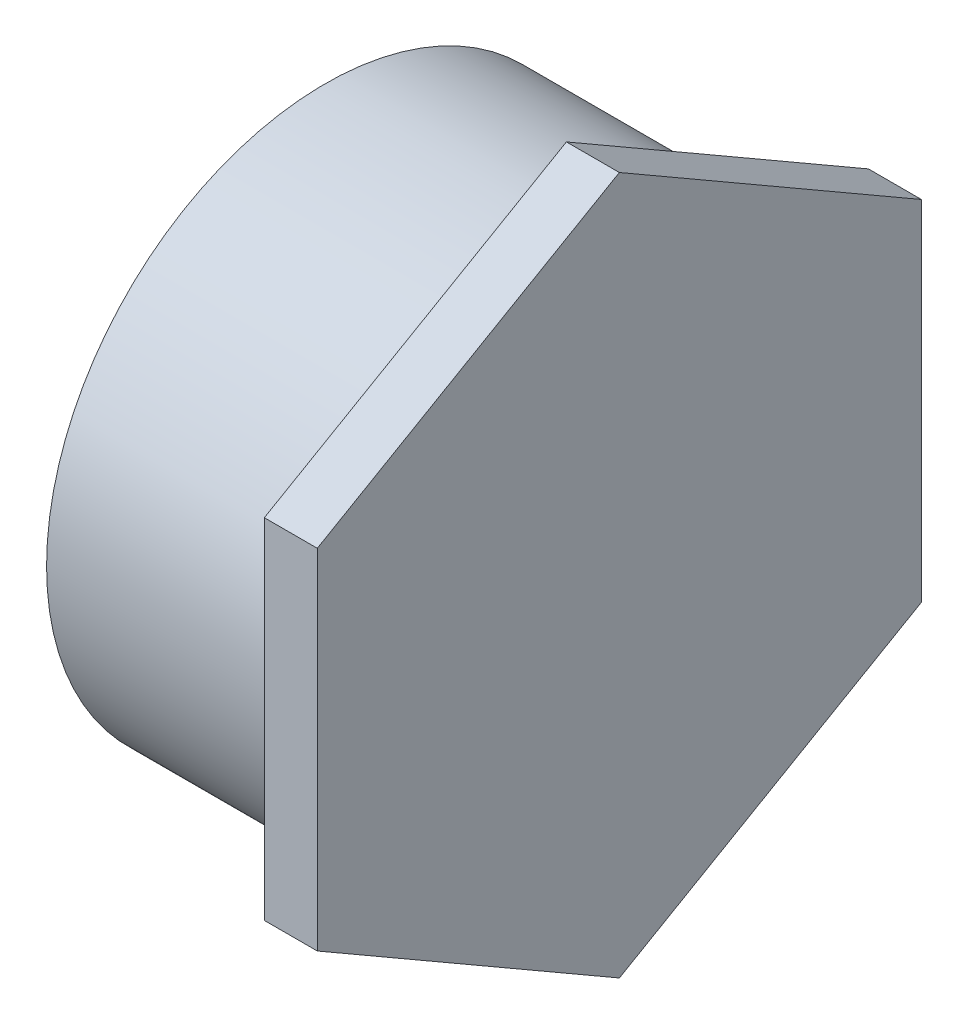
ISO-10303-21;
HEADER;
FILE_DESCRIPTION(('STEP AP214'),'2;1');
FILE_NAME('part.step','',(''),(''),'','','');
FILE_SCHEMA(('AUTOMOTIVE_DESIGN { 1 0 10303 214 1 1 1 1 }'));
ENDSEC;
DATA;
#1=APPLICATION_CONTEXT('core data for automotive mechanical design processes');
#2=APPLICATION_PROTOCOL_DEFINITION('international standard','automotive_design',2000,#1);
#3=PRODUCT_CONTEXT('',#1,'mechanical');
#4=PRODUCT('Part','Part','',(#3));
#5=PRODUCT_RELATED_PRODUCT_CATEGORY('part','',(#4));
#6=PRODUCT_DEFINITION_FORMATION('','',#4);
#7=PRODUCT_DEFINITION_CONTEXT('part definition',#1,'design');
#8=PRODUCT_DEFINITION('design','',#6,#7);
#9=PRODUCT_DEFINITION_SHAPE('','',#8);
#10=(LENGTH_UNIT() NAMED_UNIT(*) SI_UNIT(.MILLI.,.METRE.));
#11=(NAMED_UNIT(*) PLANE_ANGLE_UNIT() SI_UNIT($,.RADIAN.));
#12=(NAMED_UNIT(*) SI_UNIT($,.STERADIAN.) SOLID_ANGLE_UNIT());
#13=UNCERTAINTY_MEASURE_WITH_UNIT(LENGTH_MEASURE(1.E-05),#10,'distance_accuracy_value','');
#14=(GEOMETRIC_REPRESENTATION_CONTEXT(3) GLOBAL_UNCERTAINTY_ASSIGNED_CONTEXT((#13)) GLOBAL_UNIT_ASSIGNED_CONTEXT((#10,
#11,#12)) REPRESENTATION_CONTEXT('',''));
#15=CARTESIAN_POINT('',(0.,0.,0.));
#16=DIRECTION('',(0.,0.,1.));
#17=DIRECTION('',(1.,0.,0.));
#18=AXIS2_PLACEMENT_3D('',#15,#16,#17);
#19=CARTESIAN_POINT('',(-44.45,-77.0255,0.));
#20=DIRECTION('',(-1.,0.,0.));
#21=DIRECTION('',(0.,0.,1.));
#22=AXIS2_PLACEMENT_3D('',#19,#20,#21);
#23=PLANE('',#22);
#24=CARTESIAN_POINT('',(-44.45,0.,0.));
#25=DIRECTION('',(-1.,0.,0.));
#26=DIRECTION('',(0.,0.,1.));
#27=AXIS2_PLACEMENT_3D('',#24,#25,#26);
#28=CIRCLE('',#27,84.1375);
#29=CARTESIAN_POINT('',(-44.45,0.,84.1375));
#30=VERTEX_POINT('',#29);
#31=EDGE_CURVE('E13',#30,#30,#28,.T.);
#32=ORIENTED_EDGE('',*,*,#31,.T.);
#33=EDGE_LOOP('',(#32));
#34=FACE_BOUND('',#33,.T.);
#35=CARTESIAN_POINT('',(-44.45,0.,0.));
#36=DIRECTION('',(-1.,0.,0.));
#37=DIRECTION('',(0.,0.,1.));
#38=AXIS2_PLACEMENT_3D('',#35,#36,#37);
#39=CIRCLE('',#38,77.0255);
#40=CARTESIAN_POINT('',(-44.45,0.,77.0255));
#41=VERTEX_POINT('',#40);
#42=EDGE_CURVE('E128',#41,#41,#39,.T.);
#43=ORIENTED_EDGE('',*,*,#42,.F.);
#44=EDGE_LOOP('',(#43));
#45=FACE_BOUND('',#44,.T.);
#46=ADVANCED_FACE('F46',(#34,#45),#23,.T.);
#47=CARTESIAN_POINT('',(-44.45,0.,0.));
#48=DIRECTION('',(-1.,0.,0.));
#49=DIRECTION('',(0.,0.,1.));
#50=AXIS2_PLACEMENT_3D('',#47,#48,#49);
#51=CYLINDRICAL_SURFACE('',#50,84.1375);
#52=CARTESIAN_POINT('',(28.448,0.,0.));
#53=DIRECTION('',(-1.,0.,0.));
#54=DIRECTION('',(0.,0.,1.));
#55=AXIS2_PLACEMENT_3D('',#52,#53,#54);
#56=CIRCLE('',#55,84.1375);
#57=CARTESIAN_POINT('',(28.448,0.,84.1375));
#58=VERTEX_POINT('',#57);
#59=EDGE_CURVE('E54',#58,#58,#56,.T.);
#60=ORIENTED_EDGE('',*,*,#59,.T.);
#61=EDGE_LOOP('',(#60));
#62=FACE_BOUND('',#61,.T.);
#63=ORIENTED_EDGE('',*,*,#31,.F.);
#64=EDGE_LOOP('',(#63));
#65=FACE_BOUND('',#64,.T.);
#66=ADVANCED_FACE('F137',(#62,#65),#51,.T.);
#67=CARTESIAN_POINT('',(28.448,-91.2495,0.));
#68=DIRECTION('',(-1.,0.,0.));
#69=DIRECTION('',(0.,0.,1.));
#70=AXIS2_PLACEMENT_3D('',#67,#68,#69);
#71=PLANE('',#70);
#72=DIRECTION('',(0.,-0.5,0.866025403784439));
#73=VECTOR('',#72,1.);
#74=CARTESIAN_POINT('',(28.448,-52.6829233884187,-91.2495));
#75=LINE('',#74,#73);
#76=CARTESIAN_POINT('',(28.448,-52.6829233884187,-91.2495));
#77=VERTEX_POINT('',#76);
#78=CARTESIAN_POINT('',(28.448,-105.365846776837,0.));
#79=VERTEX_POINT('',#78);
#80=EDGE_CURVE('E106',#77,#79,#75,.T.);
#81=ORIENTED_EDGE('',*,*,#80,.T.);
#82=DIRECTION('',(0.,0.500000000000001,0.866025403784439));
#83=VECTOR('',#82,1.);
#84=CARTESIAN_POINT('',(28.448,-105.365846776837,0.));
#85=LINE('',#84,#83);
#86=CARTESIAN_POINT('',(28.448,-52.6829233884187,91.2495));
#87=VERTEX_POINT('',#86);
#88=EDGE_CURVE('E103',#79,#87,#85,.T.);
#89=ORIENTED_EDGE('',*,*,#88,.T.);
#90=DIRECTION('',(0.,1.,0.));
#91=VECTOR('',#90,1.);
#92=CARTESIAN_POINT('',(28.448,-52.6829233884187,91.2495));
#93=LINE('',#92,#91);
#94=CARTESIAN_POINT('',(28.448,52.682923388419,91.2495));
#95=VERTEX_POINT('',#94);
#96=EDGE_CURVE('E203',#87,#95,#93,.T.);
#97=ORIENTED_EDGE('',*,*,#96,.T.);
#98=DIRECTION('',(0.,0.5,-0.866025403784439));
#99=VECTOR('',#98,1.);
#100=CARTESIAN_POINT('',(28.448,52.682923388419,91.2495));
#101=LINE('',#100,#99);
#102=CARTESIAN_POINT('',(28.448,105.365846776837,0.));
#103=VERTEX_POINT('',#102);
#104=EDGE_CURVE('E121',#95,#103,#101,.T.);
#105=ORIENTED_EDGE('',*,*,#104,.T.);
#106=DIRECTION('',(0.,-0.500000000000001,-0.866025403784439));
#107=VECTOR('',#106,1.);
#108=CARTESIAN_POINT('',(28.448,105.365846776837,0.));
#109=LINE('',#108,#107);
#110=CARTESIAN_POINT('',(28.448,52.6829233884187,-91.2495000000001));
#111=VERTEX_POINT('',#110);
#112=EDGE_CURVE('E115',#103,#111,#109,.T.);
#113=ORIENTED_EDGE('',*,*,#112,.T.);
#114=DIRECTION('',(0.,-1.,0.));
#115=VECTOR('',#114,1.);
#116=CARTESIAN_POINT('',(28.448,52.6829233884187,-91.2495000000001));
#117=LINE('',#116,#115);
#118=EDGE_CURVE('E62',#111,#77,#117,.T.);
#119=ORIENTED_EDGE('',*,*,#118,.T.);
#120=EDGE_LOOP('',(#81,#89,#97,#105,#113,#119));
#121=FACE_BOUND('',#120,.T.);
#122=ORIENTED_EDGE('',*,*,#59,.F.);
#123=EDGE_LOOP('',(#122));
#124=FACE_BOUND('',#123,.T.);
#125=ADVANCED_FACE('F112',(#121,#124),#71,.T.);
#126=CARTESIAN_POINT('',(28.448,0.,0.));
#127=DIRECTION('',(-1.,0.,0.));
#128=DIRECTION('',(0.,0.,1.));
#129=AXIS2_PLACEMENT_3D('',#126,#127,#128);
#130=PLANE('',#129);
#131=CARTESIAN_POINT('',(28.448,0.,0.));
#132=DIRECTION('',(-1.,0.,0.));
#133=DIRECTION('',(0.,0.,1.));
#134=AXIS2_PLACEMENT_3D('',#131,#132,#133);
#135=CIRCLE('',#134,77.0255);
#136=CARTESIAN_POINT('',(28.448,0.,77.0255));
#137=VERTEX_POINT('',#136);
#138=EDGE_CURVE('E132',#137,#137,#135,.T.);
#139=ORIENTED_EDGE('',*,*,#138,.T.);
#140=EDGE_LOOP('',(#139));
#141=FACE_BOUND('',#140,.T.);
#142=ADVANCED_FACE('F140',(#141),#130,.T.);
#143=CARTESIAN_POINT('',(-44.45,0.,0.));
#144=DIRECTION('',(-1.,0.,0.));
#145=DIRECTION('',(0.,0.,1.));
#146=AXIS2_PLACEMENT_3D('',#143,#144,#145);
#147=CYLINDRICAL_SURFACE('',#146,77.0255);
#148=ORIENTED_EDGE('',*,*,#42,.T.);
#149=EDGE_LOOP('',(#148));
#150=FACE_BOUND('',#149,.T.);
#151=ORIENTED_EDGE('',*,*,#138,.F.);
#152=EDGE_LOOP('',(#151));
#153=FACE_BOUND('',#152,.T.);
#154=ADVANCED_FACE('F146',(#150,#153),#147,.F.);
#155=CARTESIAN_POINT('',(323.221827251249,52.6829233884187,-91.2495000000001));
#156=DIRECTION('',(0.,0.,-1.));
#157=DIRECTION('',(0.,1.,0.));
#158=AXIS2_PLACEMENT_3D('',#155,#156,#157);
#159=PLANE('',#158);
#160=DIRECTION('',(0.,-1.,0.));
#161=VECTOR('',#160,1.);
#162=CARTESIAN_POINT('',(44.45,52.6829233884187,-91.2495000000001));
#163=LINE('',#162,#161);
#164=CARTESIAN_POINT('',(44.45,52.6829233884187,-91.2495000000001));
#165=VERTEX_POINT('',#164);
#166=CARTESIAN_POINT('',(44.45,-52.6829233884187,-91.2495));
#167=VERTEX_POINT('',#166);
#168=EDGE_CURVE('E91',#165,#167,#163,.T.);
#169=ORIENTED_EDGE('',*,*,#168,.T.);
#170=DIRECTION('',(-1.,0.,0.));
#171=VECTOR('',#170,1.);
#172=CARTESIAN_POINT('',(323.221827251249,-52.6829233884187,-91.2495));
#173=LINE('',#172,#171);
#174=EDGE_CURVE('E108',#167,#77,#173,.T.);
#175=ORIENTED_EDGE('',*,*,#174,.T.);
#176=ORIENTED_EDGE('',*,*,#118,.F.);
#177=DIRECTION('',(-1.,0.,0.));
#178=VECTOR('',#177,1.);
#179=CARTESIAN_POINT('',(323.221827251249,52.6829233884187,-91.2495000000001));
#180=LINE('',#179,#178);
#181=EDGE_CURVE('E126',#165,#111,#180,.T.);
#182=ORIENTED_EDGE('',*,*,#181,.F.);
#183=EDGE_LOOP('',(#169,#175,#176,#182));
#184=FACE_BOUND('',#183,.T.);
#185=ADVANCED_FACE('F118',(#184),#159,.T.);
#186=CARTESIAN_POINT('',(323.221827251249,-52.6829233884187,-91.2495));
#187=DIRECTION('',(0.,-0.866025403784439,-0.5));
#188=DIRECTION('',(0.,0.5,-0.866025403784439));
#189=AXIS2_PLACEMENT_3D('',#186,#187,#188);
#190=PLANE('',#189);
#191=DIRECTION('',(0.,-0.5,0.866025403784439));
#192=VECTOR('',#191,1.);
#193=CARTESIAN_POINT('',(44.45,-52.6829233884187,-91.2495));
#194=LINE('',#193,#192);
#195=CARTESIAN_POINT('',(44.45,-105.365846776837,0.));
#196=VERTEX_POINT('',#195);
#197=EDGE_CURVE('E86',#167,#196,#194,.T.);
#198=ORIENTED_EDGE('',*,*,#197,.T.);
#199=DIRECTION('',(-1.,0.,0.));
#200=VECTOR('',#199,1.);
#201=CARTESIAN_POINT('',(323.221827251249,-105.365846776837,0.));
#202=LINE('',#201,#200);
#203=EDGE_CURVE('E109',#196,#79,#202,.T.);
#204=ORIENTED_EDGE('',*,*,#203,.T.);
#205=ORIENTED_EDGE('',*,*,#80,.F.);
#206=ORIENTED_EDGE('',*,*,#174,.F.);
#207=EDGE_LOOP('',(#198,#204,#205,#206));
#208=FACE_BOUND('',#207,.T.);
#209=ADVANCED_FACE('F107',(#208),#190,.T.);
#210=CARTESIAN_POINT('',(323.221827251249,-105.365846776837,0.));
#211=DIRECTION('',(0.,-0.866025403784439,0.500000000000001));
#212=DIRECTION('',(0.,-0.500000000000001,-0.866025403784439));
#213=AXIS2_PLACEMENT_3D('',#210,#211,#212);
#214=PLANE('',#213);
#215=DIRECTION('',(0.,0.500000000000001,0.866025403784439));
#216=VECTOR('',#215,1.);
#217=CARTESIAN_POINT('',(44.45,-105.365846776837,0.));
#218=LINE('',#217,#216);
#219=CARTESIAN_POINT('',(44.45,-52.6829233884187,91.2495));
#220=VERTEX_POINT('',#219);
#221=EDGE_CURVE('E196',#196,#220,#218,.T.);
#222=ORIENTED_EDGE('',*,*,#221,.T.);
#223=DIRECTION('',(-1.,0.,0.));
#224=VECTOR('',#223,1.);
#225=CARTESIAN_POINT('',(323.221827251249,-52.6829233884187,91.2495));
#226=LINE('',#225,#224);
#227=EDGE_CURVE('E195',#220,#87,#226,.T.);
#228=ORIENTED_EDGE('',*,*,#227,.T.);
#229=ORIENTED_EDGE('',*,*,#88,.F.);
#230=ORIENTED_EDGE('',*,*,#203,.F.);
#231=EDGE_LOOP('',(#222,#228,#229,#230));
#232=FACE_BOUND('',#231,.T.);
#233=ADVANCED_FACE('F207',(#232),#214,.T.);
#234=CARTESIAN_POINT('',(323.221827251249,-52.6829233884187,91.2495));
#235=DIRECTION('',(0.,0.,1.));
#236=DIRECTION('',(0.,-1.,0.));
#237=AXIS2_PLACEMENT_3D('',#234,#235,#236);
#238=PLANE('',#237);
#239=DIRECTION('',(0.,1.,0.));
#240=VECTOR('',#239,1.);
#241=CARTESIAN_POINT('',(44.45,-52.6829233884187,91.2495));
#242=LINE('',#241,#240);
#243=CARTESIAN_POINT('',(44.45,52.682923388419,91.2495));
#244=VERTEX_POINT('',#243);
#245=EDGE_CURVE('E194',#220,#244,#242,.T.);
#246=ORIENTED_EDGE('',*,*,#245,.T.);
#247=DIRECTION('',(-1.,0.,0.));
#248=VECTOR('',#247,1.);
#249=CARTESIAN_POINT('',(323.221827251249,52.682923388419,91.2495));
#250=LINE('',#249,#248);
#251=EDGE_CURVE('E189',#244,#95,#250,.T.);
#252=ORIENTED_EDGE('',*,*,#251,.T.);
#253=ORIENTED_EDGE('',*,*,#96,.F.);
#254=ORIENTED_EDGE('',*,*,#227,.F.);
#255=EDGE_LOOP('',(#246,#252,#253,#254));
#256=FACE_BOUND('',#255,.T.);
#257=ADVANCED_FACE('F206',(#256),#238,.T.);
#258=CARTESIAN_POINT('',(323.221827251249,52.682923388419,91.2495));
#259=DIRECTION('',(0.,0.866025403784439,0.5));
#260=DIRECTION('',(0.,-0.5,0.866025403784439));
#261=AXIS2_PLACEMENT_3D('',#258,#259,#260);
#262=PLANE('',#261);
#263=DIRECTION('',(0.,0.5,-0.866025403784439));
#264=VECTOR('',#263,1.);
#265=CARTESIAN_POINT('',(44.45,52.682923388419,91.2495));
#266=LINE('',#265,#264);
#267=CARTESIAN_POINT('',(44.45,105.365846776837,0.));
#268=VERTEX_POINT('',#267);
#269=EDGE_CURVE('E181',#244,#268,#266,.T.);
#270=ORIENTED_EDGE('',*,*,#269,.T.);
#271=DIRECTION('',(-1.,0.,0.));
#272=VECTOR('',#271,1.);
#273=CARTESIAN_POINT('',(323.221827251249,105.365846776837,0.));
#274=LINE('',#273,#272);
#275=EDGE_CURVE('E183',#268,#103,#274,.T.);
#276=ORIENTED_EDGE('',*,*,#275,.T.);
#277=ORIENTED_EDGE('',*,*,#104,.F.);
#278=ORIENTED_EDGE('',*,*,#251,.F.);
#279=EDGE_LOOP('',(#270,#276,#277,#278));
#280=FACE_BOUND('',#279,.T.);
#281=ADVANCED_FACE('F174',(#280),#262,.T.);
#282=CARTESIAN_POINT('',(323.221827251249,105.365846776837,0.));
#283=DIRECTION('',(0.,0.866025403784439,-0.500000000000001));
#284=DIRECTION('',(0.,0.500000000000001,0.866025403784439));
#285=AXIS2_PLACEMENT_3D('',#282,#283,#284);
#286=PLANE('',#285);
#287=DIRECTION('',(0.,-0.500000000000001,-0.866025403784439));
#288=VECTOR('',#287,1.);
#289=CARTESIAN_POINT('',(44.45,105.365846776837,0.));
#290=LINE('',#289,#288);
#291=EDGE_CURVE('E129',#268,#165,#290,.T.);
#292=ORIENTED_EDGE('',*,*,#291,.T.);
#293=ORIENTED_EDGE('',*,*,#181,.T.);
#294=ORIENTED_EDGE('',*,*,#112,.F.);
#295=ORIENTED_EDGE('',*,*,#275,.F.);
#296=EDGE_LOOP('',(#292,#293,#294,#295));
#297=FACE_BOUND('',#296,.T.);
#298=ADVANCED_FACE('F169',(#297),#286,.T.);
#299=CARTESIAN_POINT('',(44.45,0.,0.));
#300=DIRECTION('',(1.,0.,0.));
#301=DIRECTION('',(0.,0.,-1.));
#302=AXIS2_PLACEMENT_3D('',#299,#300,#301);
#303=PLANE('',#302);
#304=ORIENTED_EDGE('',*,*,#291,.F.);
#305=ORIENTED_EDGE('',*,*,#269,.F.);
#306=ORIENTED_EDGE('',*,*,#245,.F.);
#307=ORIENTED_EDGE('',*,*,#221,.F.);
#308=ORIENTED_EDGE('',*,*,#197,.F.);
#309=ORIENTED_EDGE('',*,*,#168,.F.);
#310=EDGE_LOOP('',(#304,#305,#306,#307,#308,#309));
#311=FACE_BOUND('',#310,.T.);
#312=ADVANCED_FACE('F167',(#311),#303,.T.);
#313=CLOSED_SHELL('',(#46,#66,#125,#142,#154,#185,#209,#233,#257,#281,#298,#312));
#314=MANIFOLD_SOLID_BREP('B2',#313);
#315=ADVANCED_BREP_SHAPE_REPRESENTATION('',(#18,#314),#14);
#316=SHAPE_DEFINITION_REPRESENTATION(#9,#315);
ENDSEC;
END-ISO-10303-21;
